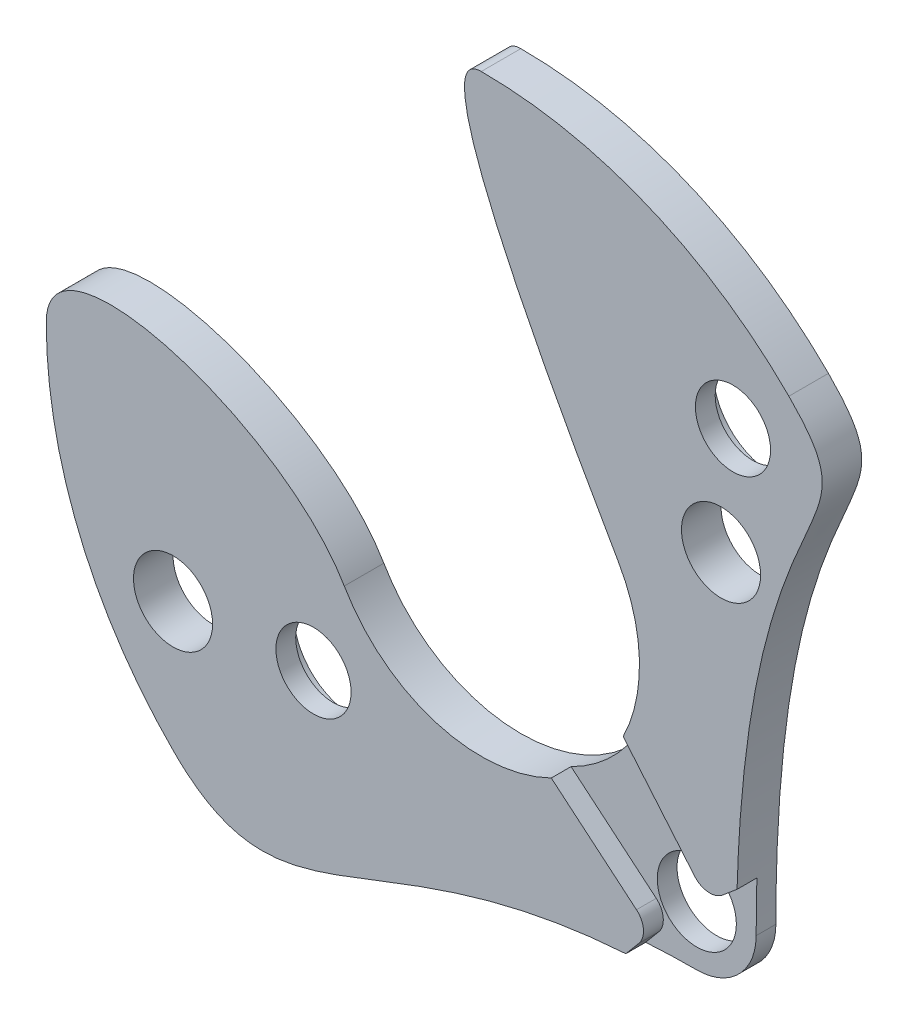
ISO-10303-21;
HEADER;
FILE_DESCRIPTION(('STEP AP214'),'2;1');
FILE_NAME('part.step','',(''),(''),'','','');
FILE_SCHEMA(('AUTOMOTIVE_DESIGN { 1 0 10303 214 1 1 1 1 }'));
ENDSEC;
DATA;
#1=APPLICATION_CONTEXT('core data for automotive mechanical design processes');
#2=APPLICATION_PROTOCOL_DEFINITION('international standard','automotive_design',2000,#1);
#3=PRODUCT_CONTEXT('',#1,'mechanical');
#4=PRODUCT('Part','Part','',(#3));
#5=PRODUCT_RELATED_PRODUCT_CATEGORY('part','',(#4));
#6=PRODUCT_DEFINITION_FORMATION('','',#4);
#7=PRODUCT_DEFINITION_CONTEXT('part definition',#1,'design');
#8=PRODUCT_DEFINITION('design','',#6,#7);
#9=PRODUCT_DEFINITION_SHAPE('','',#8);
#10=(LENGTH_UNIT() NAMED_UNIT(*) SI_UNIT(.MILLI.,.METRE.));
#11=(NAMED_UNIT(*) PLANE_ANGLE_UNIT() SI_UNIT($,.RADIAN.));
#12=(NAMED_UNIT(*) SI_UNIT($,.STERADIAN.) SOLID_ANGLE_UNIT());
#13=UNCERTAINTY_MEASURE_WITH_UNIT(LENGTH_MEASURE(1.E-05),#10,'distance_accuracy_value','');
#14=(GEOMETRIC_REPRESENTATION_CONTEXT(3) GLOBAL_UNCERTAINTY_ASSIGNED_CONTEXT((#13)) GLOBAL_UNIT_ASSIGNED_CONTEXT((#10,
#11,#12)) REPRESENTATION_CONTEXT('',''));
#15=CARTESIAN_POINT('',(0.,0.,0.));
#16=DIRECTION('',(0.,0.,1.));
#17=DIRECTION('',(1.,0.,0.));
#18=AXIS2_PLACEMENT_3D('',#15,#16,#17);
#19=CARTESIAN_POINT('',(2.47487373415291,-2.47487373415292,0.5));
#20=DIRECTION('',(0.,0.,-1.));
#21=DIRECTION('',(-1.,0.,0.));
#22=AXIS2_PLACEMENT_3D('',#19,#20,#21);
#23=CYLINDRICAL_SURFACE('',#22,0.75);
#24=CARTESIAN_POINT('',(2.47487373415291,-2.47487373415292,0.25));
#25=DIRECTION('',(0.,0.,1.));
#26=DIRECTION('',(1.,0.,0.));
#27=AXIS2_PLACEMENT_3D('',#24,#25,#26);
#28=CIRCLE('',#27,0.75);
#29=CARTESIAN_POINT('',(2.47487376398667,-3.22487373415292,0.25));
#30=VERTEX_POINT('',#29);
#31=CARTESIAN_POINT('',(3.22487373415291,-2.4748737603287,0.25));
#32=VERTEX_POINT('',#31);
#33=EDGE_CURVE('E237',#30,#32,#28,.T.);
#34=ORIENTED_EDGE('',*,*,#33,.F.);
#35=DIRECTION('',(0.,0.,-1.));
#36=VECTOR('',#35,1.);
#37=CARTESIAN_POINT('',(2.47487373415291,-3.22487373415292,0.5));
#38=LINE('',#37,#36);
#39=CARTESIAN_POINT('',(2.47487373415291,-3.22487373415292,0.));
#40=VERTEX_POINT('',#39);
#41=EDGE_CURVE('E215',#30,#40,#38,.T.);
#42=ORIENTED_EDGE('',*,*,#41,.T.);
#43=CARTESIAN_POINT('',(2.47487373415291,-2.47487373415292,0.));
#44=DIRECTION('',(0.,0.,1.));
#45=DIRECTION('',(1.,0.,0.));
#46=AXIS2_PLACEMENT_3D('',#43,#44,#45);
#47=CIRCLE('',#46,0.75);
#48=CARTESIAN_POINT('',(3.22487373415291,-2.47487373415292,0.));
#49=VERTEX_POINT('',#48);
#50=EDGE_CURVE('E457',#40,#49,#47,.T.);
#51=ORIENTED_EDGE('',*,*,#50,.T.);
#52=DIRECTION('',(0.,0.,-1.));
#53=VECTOR('',#52,1.);
#54=CARTESIAN_POINT('',(3.22487373415291,-2.47487373415292,0.5));
#55=LINE('',#54,#53);
#56=EDGE_CURVE('E127',#32,#49,#55,.T.);
#57=ORIENTED_EDGE('',*,*,#56,.F.);
#58=EDGE_LOOP('',(#34,#42,#51,#57));
#59=FACE_BOUND('',#58,.T.);
#60=ADVANCED_FACE('F40',(#59),#23,.T.);
#61=CARTESIAN_POINT('',(2.47487373415291,-2.47487373415292,0.5));
#62=DIRECTION('',(0.,0.,-1.));
#63=DIRECTION('',(-1.,0.,0.));
#64=AXIS2_PLACEMENT_3D('',#61,#62,#63);
#65=CYLINDRICAL_SURFACE('',#64,0.5);
#66=CARTESIAN_POINT('',(2.47487373415291,-2.47487373415292,0.));
#67=DIRECTION('',(0.,0.,1.));
#68=DIRECTION('',(1.,0.,0.));
#69=AXIS2_PLACEMENT_3D('',#66,#67,#68);
#70=CIRCLE('',#69,0.5);
#71=CARTESIAN_POINT('',(2.97487373415291,-2.47487373415292,0.));
#72=VERTEX_POINT('',#71);
#73=EDGE_CURVE('E289',#72,#72,#70,.T.);
#74=ORIENTED_EDGE('',*,*,#73,.F.);
#75=EDGE_LOOP('',(#74));
#76=FACE_BOUND('',#75,.T.);
#77=CARTESIAN_POINT('',(2.47487373415291,-2.47487373415292,0.25));
#78=DIRECTION('',(0.,0.,1.));
#79=DIRECTION('',(1.,0.,0.));
#80=AXIS2_PLACEMENT_3D('',#77,#78,#79);
#81=CIRCLE('',#80,0.5);
#82=CARTESIAN_POINT('',(2.97487373415291,-2.47487373415292,0.25));
#83=VERTEX_POINT('',#82);
#84=EDGE_CURVE('E152',#83,#83,#81,.T.);
#85=ORIENTED_EDGE('',*,*,#84,.T.);
#86=EDGE_LOOP('',(#85));
#87=FACE_BOUND('',#86,.T.);
#88=ADVANCED_FACE('F42',(#76,#87),#65,.F.);
#89=CARTESIAN_POINT('',(-0.494504817633697,-10.7938034400006,0.5));
#90=DIRECTION('',(0.,0.,1.));
#91=DIRECTION('',(1.,0.,0.));
#92=AXIS2_PLACEMENT_3D('',#89,#90,#91);
#93=PLANE('',#92);
#94=CARTESIAN_POINT('',(3.18198051533946,3.18198051533947,0.5));
#95=DIRECTION('',(0.,0.,1.));
#96=DIRECTION('',(1.,0.,0.));
#97=AXIS2_PLACEMENT_3D('',#94,#95,#96);
#98=CIRCLE('',#97,0.474999999999994);
#99=CARTESIAN_POINT('',(3.65698051533945,3.18198051533947,0.5));
#100=VERTEX_POINT('',#99);
#101=EDGE_CURVE('E306',#100,#100,#98,.T.);
#102=ORIENTED_EDGE('',*,*,#101,.F.);
#103=EDGE_LOOP('',(#102));
#104=FACE_BOUND('',#103,.T.);
#105=DIRECTION('',(-0.642787609686543,0.766044443118975,0.));
#106=VECTOR('',#105,1.);
#107=CARTESIAN_POINT('',(2.69719905329076,-1.96196881852991,0.5));
#108=LINE('',#107,#106);
#109=CARTESIAN_POINT('',(2.69719905329076,-1.96196881852991,0.5));
#110=VERTEX_POINT('',#109);
#111=CARTESIAN_POINT('',(1.79352882702642,-0.885016579858958,0.5));
#112=VERTEX_POINT('',#111);
#113=EDGE_CURVE('E319',#110,#112,#108,.T.);
#114=ORIENTED_EDGE('',*,*,#113,.F.);
#115=CARTESIAN_POINT('',(2.88871016407051,-1.80127191610827,0.5));
#116=DIRECTION('',(0.,0.,-1.));
#117=DIRECTION('',(-1.,0.,0.));
#118=AXIS2_PLACEMENT_3D('',#115,#116,#117);
#119=CIRCLE('',#118,0.25);
#120=CARTESIAN_POINT('',(3.04940706649214,-1.99278302688801,0.5));
#121=VERTEX_POINT('',#120);
#122=EDGE_CURVE('E316',#121,#110,#119,.T.);
#123=ORIENTED_EDGE('',*,*,#122,.F.);
#124=DIRECTION('',(-0.766044443119986,-0.642787609685338,0.));
#125=VECTOR('',#124,1.);
#126=CARTESIAN_POINT('',(3.04940706649214,-1.99278302688801,0.5));
#127=LINE('',#126,#125);
#128=CARTESIAN_POINT('',(3.23387528673452,-1.8379958113192,0.5));
#129=VERTEX_POINT('',#128);
#130=EDGE_CURVE('E144',#129,#121,#127,.T.);
#131=ORIENTED_EDGE('',*,*,#130,.F.);
#132=CARTESIAN_POINT('',(3.889087296526,3.88908729652602,0.5));
#133=CARTESIAN_POINT('',(5.1328934329392,2.64528116011282,0.5));
#134=CARTESIAN_POINT('',(3.22487373415291,3.01462721204346,0.5));
#135=CARTESIAN_POINT('',(3.22487373415291,-2.47487373415291,0.5));
#136=B_SPLINE_CURVE_WITH_KNOTS('',3,(#132,#133,#134,#135),.UNSPECIFIED.,.F.,.F.,(4,4),(0.,
0.76389692420124),.UNSPECIFIED.);
#137=CARTESIAN_POINT('',(3.88908729652601,3.88908729652602,0.5));
#138=VERTEX_POINT('',#137);
#139=EDGE_CURVE('E121',#138,#129,#136,.T.);
#140=ORIENTED_EDGE('',*,*,#139,.F.);
#141=CARTESIAN_POINT('',(0.,0.,0.5));
#142=DIRECTION('',(0.,0.,1.));
#143=DIRECTION('',(1.,0.,0.));
#144=AXIS2_PLACEMENT_3D('',#141,#142,#143);
#145=CIRCLE('',#144,5.5);
#146=CARTESIAN_POINT('',(0.,5.5,0.5));
#147=VERTEX_POINT('',#146);
#148=EDGE_CURVE('E131',#138,#147,#145,.T.);
#149=ORIENTED_EDGE('',*,*,#148,.T.);
#150=CARTESIAN_POINT('',(1.73205080756888,1.,0.5));
#151=CARTESIAN_POINT('',(0.948721343771961,2.35676643036194,0.5));
#152=CARTESIAN_POINT('',(-0.820788378407405,5.5,0.5));
#153=CARTESIAN_POINT('',(0.,5.5,0.5));
#154=B_SPLINE_CURVE_WITH_KNOTS('',3,(#150,#151,#152,#153),.UNSPECIFIED.,.F.,.F.,(4,4),(0.,1.),.UNSPECIFIED.);
#155=CARTESIAN_POINT('',(1.73205080756888,1.,0.5));
#156=VERTEX_POINT('',#155);
#157=EDGE_CURVE('E136',#156,#147,#154,.T.);
#158=ORIENTED_EDGE('',*,*,#157,.F.);
#159=CARTESIAN_POINT('',(0.,0.,0.5));
#160=DIRECTION('',(0.,0.,1.));
#161=DIRECTION('',(1.,0.,0.));
#162=AXIS2_PLACEMENT_3D('',#159,#160,#161);
#163=CIRCLE('',#162,2.);
#164=EDGE_CURVE('E66',#112,#156,#163,.T.);
#165=ORIENTED_EDGE('',*,*,#164,.F.);
#166=EDGE_LOOP('',(#114,#123,#131,#140,#149,#158,#165));
#167=FACE_BOUND('',#166,.T.);
#168=CARTESIAN_POINT('',(3.03108891324553,1.75,0.5));
#169=DIRECTION('',(0.,0.,1.));
#170=DIRECTION('',(1.,0.,0.));
#171=AXIS2_PLACEMENT_3D('',#168,#169,#170);
#172=CIRCLE('',#171,0.5);
#173=CARTESIAN_POINT('',(3.53108891324553,1.75,0.5));
#174=VERTEX_POINT('',#173);
#175=EDGE_CURVE('E292',#174,#174,#172,.T.);
#176=ORIENTED_EDGE('',*,*,#175,.F.);
#177=EDGE_LOOP('',(#176));
#178=FACE_BOUND('',#177,.T.);
#179=ADVANCED_FACE('F140',(#104,#167,#178),#93,.T.);
#180=CARTESIAN_POINT('',(0.,0.,0.5));
#181=DIRECTION('',(0.,0.,-1.));
#182=DIRECTION('',(-1.,0.,0.));
#183=AXIS2_PLACEMENT_3D('',#180,#181,#182);
#184=CYLINDRICAL_SURFACE('',#183,2.);
#185=DIRECTION('',(0.,0.,1.));
#186=VECTOR('',#185,1.);
#187=CARTESIAN_POINT('',(1.79352882702642,-0.885016579858958,0.25));
#188=LINE('',#187,#186);
#189=CARTESIAN_POINT('',(1.79352882702642,-0.885016579858958,0.25));
#190=VERTEX_POINT('',#189);
#191=EDGE_CURVE('E323',#190,#112,#188,.T.);
#192=ORIENTED_EDGE('',*,*,#191,.T.);
#193=ORIENTED_EDGE('',*,*,#164,.T.);
#194=DIRECTION('',(0.,0.,-1.));
#195=VECTOR('',#194,1.);
#196=CARTESIAN_POINT('',(1.73205080756888,1.,0.5));
#197=LINE('',#196,#195);
#198=CARTESIAN_POINT('',(1.73205080756888,1.,0.));
#199=VERTEX_POINT('',#198);
#200=EDGE_CURVE('E96',#156,#199,#197,.T.);
#201=ORIENTED_EDGE('',*,*,#200,.T.);
#202=CARTESIAN_POINT('',(0.,0.,0.));
#203=DIRECTION('',(0.,0.,1.));
#204=DIRECTION('',(1.,0.,0.));
#205=AXIS2_PLACEMENT_3D('',#202,#203,#204);
#206=CIRCLE('',#205,2.);
#207=CARTESIAN_POINT('',(-1.73205080756888,-1.,0.));
#208=VERTEX_POINT('',#207);
#209=EDGE_CURVE('E420',#208,#199,#206,.T.);
#210=ORIENTED_EDGE('',*,*,#209,.F.);
#211=DIRECTION('',(0.,0.,-1.));
#212=VECTOR('',#211,1.);
#213=CARTESIAN_POINT('',(-1.73205080756888,-1.,0.5));
#214=LINE('',#213,#212);
#215=CARTESIAN_POINT('',(-1.73205080756888,-1.,0.5));
#216=VERTEX_POINT('',#215);
#217=EDGE_CURVE('E11',#216,#208,#214,.T.);
#218=ORIENTED_EDGE('',*,*,#217,.F.);
#219=CARTESIAN_POINT('',(0.885016579858952,-1.79352882702642,0.5));
#220=VERTEX_POINT('',#219);
#221=EDGE_CURVE('E195',#216,#220,#163,.T.);
#222=ORIENTED_EDGE('',*,*,#221,.T.);
#223=DIRECTION('',(0.,0.,1.));
#224=VECTOR('',#223,1.);
#225=CARTESIAN_POINT('',(0.885016579858951,-1.79352882702642,0.25));
#226=LINE('',#225,#224);
#227=CARTESIAN_POINT('',(0.885016579858951,-1.79352882702642,0.25));
#228=VERTEX_POINT('',#227);
#229=EDGE_CURVE('E57',#228,#220,#226,.T.);
#230=ORIENTED_EDGE('',*,*,#229,.F.);
#231=CARTESIAN_POINT('',(0.,0.,0.25));
#232=DIRECTION('',(0.,0.,-1.));
#233=DIRECTION('',(1.,0.,0.));
#234=AXIS2_PLACEMENT_3D('',#231,#232,#233);
#235=CIRCLE('',#234,2.);
#236=EDGE_CURVE('E322',#190,#228,#235,.T.);
#237=ORIENTED_EDGE('',*,*,#236,.F.);
#238=EDGE_LOOP('',(#192,#193,#201,#210,#218,#222,#230,#237));
#239=FACE_BOUND('',#238,.T.);
#240=ADVANCED_FACE('F186',(#239),#184,.F.);
#241=CARTESIAN_POINT('',(-1.73205080756888,-1.,0.5));
#242=CARTESIAN_POINT('',(-2.51538027136579,0.356766430361937,0.5));
#243=CARTESIAN_POINT('',(-5.5,1.2621162955933,0.5));
#244=CARTESIAN_POINT('',(-5.5,0.,0.5));
#245=B_SPLINE_CURVE_WITH_KNOTS('',3,(#241,#242,#243,#244),.UNSPECIFIED.,.F.,.F.,(4,4),(0.,1.),.UNSPECIFIED.);
#246=DIRECTION('',(0.,0.,-1.));
#247=VECTOR('',#246,1.);
#248=SURFACE_OF_LINEAR_EXTRUSION('',#245,#247);
#249=CARTESIAN_POINT('',(-1.73205080756888,-1.,0.));
#250=CARTESIAN_POINT('',(-2.51538027136579,0.356766430361937,0.));
#251=CARTESIAN_POINT('',(-5.5,1.2621162955933,0.));
#252=CARTESIAN_POINT('',(-5.5,0.,0.));
#253=B_SPLINE_CURVE_WITH_KNOTS('',3,(#249,#250,#251,#252),.UNSPECIFIED.,.F.,.F.,(4,4),(0.,1.),.UNSPECIFIED.);
#254=CARTESIAN_POINT('',(-5.5,0.,0.));
#255=VERTEX_POINT('',#254);
#256=EDGE_CURVE('E423',#208,#255,#253,.T.);
#257=ORIENTED_EDGE('',*,*,#256,.T.);
#258=DIRECTION('',(0.,0.,-1.));
#259=VECTOR('',#258,1.);
#260=CARTESIAN_POINT('',(-5.5,0.,0.5));
#261=LINE('',#260,#259);
#262=CARTESIAN_POINT('',(-5.5,0.,0.5));
#263=VERTEX_POINT('',#262);
#264=EDGE_CURVE('E49',#263,#255,#261,.T.);
#265=ORIENTED_EDGE('',*,*,#264,.F.);
#266=EDGE_CURVE('E189',#216,#263,#245,.T.);
#267=ORIENTED_EDGE('',*,*,#266,.F.);
#268=ORIENTED_EDGE('',*,*,#217,.T.);
#269=EDGE_LOOP('',(#257,#265,#267,#268));
#270=FACE_BOUND('',#269,.T.);
#271=ADVANCED_FACE('F181',(#270),#248,.F.);
#272=CARTESIAN_POINT('',(0.,0.,0.5));
#273=DIRECTION('',(0.,0.,-1.));
#274=DIRECTION('',(-1.,0.,0.));
#275=AXIS2_PLACEMENT_3D('',#272,#273,#274);
#276=CYLINDRICAL_SURFACE('',#275,5.5);
#277=CARTESIAN_POINT('',(0.,0.,0.));
#278=DIRECTION('',(0.,0.,1.));
#279=DIRECTION('',(1.,0.,0.));
#280=AXIS2_PLACEMENT_3D('',#277,#278,#279);
#281=CIRCLE('',#280,5.5);
#282=CARTESIAN_POINT('',(-3.889087296526,-3.88908729652602,0.));
#283=VERTEX_POINT('',#282);
#284=EDGE_CURVE('E212',#255,#283,#281,.T.);
#285=ORIENTED_EDGE('',*,*,#284,.T.);
#286=DIRECTION('',(0.,0.,-1.));
#287=VECTOR('',#286,1.);
#288=CARTESIAN_POINT('',(-3.889087296526,-3.88908729652602,0.5));
#289=LINE('',#288,#287);
#290=CARTESIAN_POINT('',(-3.889087296526,-3.88908729652602,0.5));
#291=VERTEX_POINT('',#290);
#292=EDGE_CURVE('E211',#291,#283,#289,.T.);
#293=ORIENTED_EDGE('',*,*,#292,.F.);
#294=CARTESIAN_POINT('',(0.,0.,0.5));
#295=DIRECTION('',(0.,0.,1.));
#296=DIRECTION('',(1.,0.,0.));
#297=AXIS2_PLACEMENT_3D('',#294,#295,#296);
#298=CIRCLE('',#297,5.5);
#299=EDGE_CURVE('E147',#263,#291,#298,.T.);
#300=ORIENTED_EDGE('',*,*,#299,.F.);
#301=ORIENTED_EDGE('',*,*,#264,.T.);
#302=EDGE_LOOP('',(#285,#293,#300,#301));
#303=FACE_BOUND('',#302,.T.);
#304=ADVANCED_FACE('F177',(#303),#276,.T.);
#305=CARTESIAN_POINT('',(2.47487373415291,-3.22487373415292,0.5));
#306=CARTESIAN_POINT('',(-1.35865781035541,-3.22487373415292,0.5));
#307=CARTESIAN_POINT('',(-2.38895101914465,-5.38922357390737,0.5));
#308=CARTESIAN_POINT('',(-3.889087296526,-3.88908729652602,0.5));
#309=B_SPLINE_CURVE_WITH_KNOTS('',3,(#305,#306,#307,#308),.UNSPECIFIED.,.F.,.F.,(4,4),(0.,1.),.UNSPECIFIED.);
#310=DIRECTION('',(0.,0.,-1.));
#311=VECTOR('',#310,1.);
#312=SURFACE_OF_LINEAR_EXTRUSION('',#309,#311);
#313=DIRECTION('',(0.,0.,-1.));
#314=VECTOR('',#313,1.);
#315=CARTESIAN_POINT('',(1.82774500199745,-3.24609172557136,0.375));
#316=LINE('',#315,#314);
#317=CARTESIAN_POINT('',(1.82774500199745,-3.24609172557135,0.25));
#318=VERTEX_POINT('',#317);
#319=CARTESIAN_POINT('',(1.82774500199745,-3.24609172557135,0.5));
#320=VERTEX_POINT('',#319);
#321=EDGE_CURVE('E224',#318,#320,#316,.F.);
#322=ORIENTED_EDGE('',*,*,#321,.T.);
#323=EDGE_CURVE('E145',#320,#291,#309,.T.);
#324=ORIENTED_EDGE('',*,*,#323,.T.);
#325=ORIENTED_EDGE('',*,*,#292,.T.);
#326=CARTESIAN_POINT('',(2.47487373415291,-3.22487373415292,0.));
#327=CARTESIAN_POINT('',(-1.35865781035541,-3.22487373415292,0.));
#328=CARTESIAN_POINT('',(-2.38895101914465,-5.38922357390737,0.));
#329=CARTESIAN_POINT('',(-3.889087296526,-3.88908729652602,0.));
#330=B_SPLINE_CURVE_WITH_KNOTS('',3,(#326,#327,#328,#329),.UNSPECIFIED.,.F.,.F.,(4,4),(0.,1.),.UNSPECIFIED.);
#331=EDGE_CURVE('E453',#40,#283,#330,.T.);
#332=ORIENTED_EDGE('',*,*,#331,.F.);
#333=ORIENTED_EDGE('',*,*,#41,.F.);
#334=CARTESIAN_POINT('',(1.82774500199745,-3.24609172557135,0.25));
#335=CARTESIAN_POINT('',(1.86365053052916,-3.243700367341,0.25));
#336=CARTESIAN_POINT('',(1.89956980319246,-3.24151639201898,0.25));
#337=CARTESIAN_POINT('',(1.97142198594582,-3.2375585421549,0.25));
#338=CARTESIAN_POINT('',(2.0073548904231,-3.23578456576244,0.25));
#339=CARTESIAN_POINT('',(2.07923401625193,-3.23264105398086,0.25));
#340=CARTESIAN_POINT('',(2.11518023547591,-3.23127146986118,0.25));
#341=CARTESIAN_POINT('',(2.18708546526036,-3.22893097957115,0.25));
#342=CARTESIAN_POINT('',(2.22304447576007,-3.22796007153133,0.25));
#343=CARTESIAN_POINT('',(2.29497543359178,-3.22641116453418,0.25));
#344=CARTESIAN_POINT('',(2.33094738198003,-3.22583321480663,0.25));
#345=CARTESIAN_POINT('',(2.40290416423566,-3.22506443963408,0.25));
#346=CARTESIAN_POINT('',(2.4388889991106,-3.22487370825222,0.25));
#347=CARTESIAN_POINT('',(2.47487376398667,-3.22487373415292,0.25));
#348=B_SPLINE_CURVE_WITH_KNOTS('',3,(#334,#335,#336,#337,#338,#339,#340,#341,#342,#343,#344,
#345,#346,#347),.UNSPECIFIED.,.F.,.F.,(4,2,2,2,2,2,4),(0.,0.107954523724107,0.215882200891527,
0.323796867114626,0.431711027298476,0.539638704467747,0.64759259631236),.UNSPECIFIED.);
#349=EDGE_CURVE('E241',#318,#30,#348,.T.);
#350=ORIENTED_EDGE('',*,*,#349,.F.);
#351=EDGE_LOOP('',(#322,#324,#325,#332,#333,#350));
#352=FACE_BOUND('',#351,.T.);
#353=ADVANCED_FACE('F170',(#352),#312,.T.);
#354=DIRECTION('',(0.,0.,-1.));
#355=VECTOR('',#354,1.);
#356=SURFACE_OF_LINEAR_EXTRUSION('',#136,#355);
#357=DIRECTION('',(0.,0.,-1.));
#358=VECTOR('',#357,1.);
#359=CARTESIAN_POINT('',(3.23387528673452,-1.8379958113192,0.375));
#360=LINE('',#359,#358);
#361=CARTESIAN_POINT('',(3.23387528673452,-1.8379958113192,0.25));
#362=VERTEX_POINT('',#361);
#363=EDGE_CURVE('E227',#362,#129,#360,.F.);
#364=ORIENTED_EDGE('',*,*,#363,.F.);
#365=CARTESIAN_POINT('',(3.22487373415291,-2.4748737603287,0.25));
#366=CARTESIAN_POINT('',(3.22487386077048,-2.42179213661784,0.25));
#367=CARTESIAN_POINT('',(3.22505213954659,-2.36871041483332,0.25));
#368=CARTESIAN_POINT('',(3.22577886468152,-2.26255230680199,0.25));
#369=CARTESIAN_POINT('',(3.22632729161678,-2.20947592042136,0.25));
#370=CARTESIAN_POINT('',(3.22780817417168,-2.10332839110768,0.25));
#371=CARTESIAN_POINT('',(3.22874063017267,-2.05025724817988,0.25));
#372=CARTESIAN_POINT('',(3.23100475274686,-1.94412071150375,0.25));
#373=CARTESIAN_POINT('',(3.23233644026555,-1.89105531820324,0.25));
#374=CARTESIAN_POINT('',(3.23387528673452,-1.8379958113192,0.25));
#375=B_SPLINE_CURVE_WITH_KNOTS('',3,(#365,#366,#367,#368,#369,#370,#371,#372,#373,#374),
.UNSPECIFIED.,.F.,.F.,(4,2,2,2,4),(0.,0.15924471371625,0.318481071696738,0.477717587800523,
0.636962459631773),.UNSPECIFIED.);
#376=EDGE_CURVE('E240',#32,#362,#375,.T.);
#377=ORIENTED_EDGE('',*,*,#376,.F.);
#378=ORIENTED_EDGE('',*,*,#56,.T.);
#379=CARTESIAN_POINT('',(3.889087296526,3.88908729652602,0.));
#380=CARTESIAN_POINT('',(5.1328934329392,2.64528116011282,0.));
#381=CARTESIAN_POINT('',(3.22487373415291,3.01462721204346,0.));
#382=CARTESIAN_POINT('',(3.22487373415291,-2.47487373415291,0.));
#383=B_SPLINE_CURVE_WITH_KNOTS('',3,(#379,#380,#381,#382),.UNSPECIFIED.,.F.,.F.,(4,4),(0.,
0.76389692420124),.UNSPECIFIED.);
#384=CARTESIAN_POINT('',(3.88908729652601,3.88908729652602,0.));
#385=VERTEX_POINT('',#384);
#386=EDGE_CURVE('E123',#385,#49,#383,.T.);
#387=ORIENTED_EDGE('',*,*,#386,.F.);
#388=DIRECTION('',(0.,0.,-1.));
#389=VECTOR('',#388,1.);
#390=CARTESIAN_POINT('',(3.88908729652601,3.88908729652602,0.5));
#391=LINE('',#390,#389);
#392=EDGE_CURVE('E115',#138,#385,#391,.T.);
#393=ORIENTED_EDGE('',*,*,#392,.F.);
#394=ORIENTED_EDGE('',*,*,#139,.T.);
#395=EDGE_LOOP('',(#364,#377,#378,#387,#393,#394));
#396=FACE_BOUND('',#395,.T.);
#397=ADVANCED_FACE('F118',(#396),#356,.T.);
#398=CARTESIAN_POINT('',(0.,0.,0.5));
#399=DIRECTION('',(0.,0.,-1.));
#400=DIRECTION('',(-1.,0.,0.));
#401=AXIS2_PLACEMENT_3D('',#398,#399,#400);
#402=CYLINDRICAL_SURFACE('',#401,5.5);
#403=CARTESIAN_POINT('',(0.,0.,0.));
#404=DIRECTION('',(0.,0.,1.));
#405=DIRECTION('',(1.,0.,0.));
#406=AXIS2_PLACEMENT_3D('',#403,#404,#405);
#407=CIRCLE('',#406,5.5);
#408=CARTESIAN_POINT('',(0.,5.5,0.));
#409=VERTEX_POINT('',#408);
#410=EDGE_CURVE('E425',#385,#409,#407,.T.);
#411=ORIENTED_EDGE('',*,*,#410,.T.);
#412=DIRECTION('',(0.,0.,-1.));
#413=VECTOR('',#412,1.);
#414=CARTESIAN_POINT('',(0.,5.5,0.5));
#415=LINE('',#414,#413);
#416=EDGE_CURVE('E128',#147,#409,#415,.T.);
#417=ORIENTED_EDGE('',*,*,#416,.F.);
#418=ORIENTED_EDGE('',*,*,#148,.F.);
#419=ORIENTED_EDGE('',*,*,#392,.T.);
#420=EDGE_LOOP('',(#411,#417,#418,#419));
#421=FACE_BOUND('',#420,.T.);
#422=ADVANCED_FACE('F132',(#421),#402,.T.);
#423=CARTESIAN_POINT('',(-3.89711431702997,-2.25,0.5));
#424=DIRECTION('',(0.,0.,-1.));
#425=DIRECTION('',(-1.,0.,0.));
#426=AXIS2_PLACEMENT_3D('',#423,#424,#425);
#427=CYLINDRICAL_SURFACE('',#426,0.499999999999999);
#428=CARTESIAN_POINT('',(-3.89711431702997,-2.25,0.5));
#429=DIRECTION('',(0.,0.,1.));
#430=DIRECTION('',(1.,0.,0.));
#431=AXIS2_PLACEMENT_3D('',#428,#429,#430);
#432=CIRCLE('',#431,0.499999999999999);
#433=CARTESIAN_POINT('',(-3.39711431702997,-2.25,0.5));
#434=VERTEX_POINT('',#433);
#435=EDGE_CURVE('E294',#434,#434,#432,.T.);
#436=ORIENTED_EDGE('',*,*,#435,.T.);
#437=EDGE_LOOP('',(#436));
#438=FACE_BOUND('',#437,.T.);
#439=CARTESIAN_POINT('',(-3.89711431702997,-2.25,0.));
#440=DIRECTION('',(0.,0.,1.));
#441=DIRECTION('',(1.,0.,0.));
#442=AXIS2_PLACEMENT_3D('',#439,#440,#441);
#443=CIRCLE('',#442,0.499999999999999);
#444=CARTESIAN_POINT('',(-3.39711431702997,-2.25,0.));
#445=VERTEX_POINT('',#444);
#446=EDGE_CURVE('E417',#445,#445,#443,.T.);
#447=ORIENTED_EDGE('',*,*,#446,.F.);
#448=EDGE_LOOP('',(#447));
#449=FACE_BOUND('',#448,.T.);
#450=ADVANCED_FACE('F675',(#438,#449),#427,.F.);
#451=CARTESIAN_POINT('',(3.03108891324553,1.75,0.5));
#452=DIRECTION('',(0.,0.,-1.));
#453=DIRECTION('',(-1.,0.,0.));
#454=AXIS2_PLACEMENT_3D('',#451,#452,#453);
#455=CYLINDRICAL_SURFACE('',#454,0.5);
#456=ORIENTED_EDGE('',*,*,#175,.T.);
#457=EDGE_LOOP('',(#456));
#458=FACE_BOUND('',#457,.T.);
#459=CARTESIAN_POINT('',(3.03108891324553,1.75,0.));
#460=DIRECTION('',(0.,0.,1.));
#461=DIRECTION('',(1.,0.,0.));
#462=AXIS2_PLACEMENT_3D('',#459,#460,#461);
#463=CIRCLE('',#462,0.5);
#464=CARTESIAN_POINT('',(3.53108891324553,1.75,0.));
#465=VERTEX_POINT('',#464);
#466=EDGE_CURVE('E413',#465,#465,#463,.T.);
#467=ORIENTED_EDGE('',*,*,#466,.F.);
#468=EDGE_LOOP('',(#467));
#469=FACE_BOUND('',#468,.T.);
#470=ADVANCED_FACE('F378',(#458,#469),#455,.F.);
#471=DIRECTION('',(0.,0.,-1.));
#472=VECTOR('',#471,1.);
#473=SURFACE_OF_LINEAR_EXTRUSION('',#154,#472);
#474=CARTESIAN_POINT('',(1.73205080756888,1.,0.));
#475=CARTESIAN_POINT('',(0.948721343771961,2.35676643036194,0.));
#476=CARTESIAN_POINT('',(-0.820788378407405,5.5,0.));
#477=CARTESIAN_POINT('',(0.,5.5,0.));
#478=B_SPLINE_CURVE_WITH_KNOTS('',3,(#474,#475,#476,#477),.UNSPECIFIED.,.F.,.F.,(4,4),(0.,1.),.UNSPECIFIED.);
#479=EDGE_CURVE('E295',#199,#409,#478,.T.);
#480=ORIENTED_EDGE('',*,*,#479,.F.);
#481=ORIENTED_EDGE('',*,*,#200,.F.);
#482=ORIENTED_EDGE('',*,*,#157,.T.);
#483=ORIENTED_EDGE('',*,*,#416,.T.);
#484=EDGE_LOOP('',(#480,#481,#482,#483));
#485=FACE_BOUND('',#484,.T.);
#486=ADVANCED_FACE('F369',(#485),#473,.T.);
#487=CARTESIAN_POINT('',(-2.12132034355964,-2.12132034355965,0.5));
#488=DIRECTION('',(0.,0.,1.));
#489=DIRECTION('',(1.,0.,0.));
#490=AXIS2_PLACEMENT_3D('',#487,#488,#489);
#491=CIRCLE('',#490,0.474999999999994);
#492=CARTESIAN_POINT('',(-1.64632034355964,-2.12132034355965,0.5));
#493=VERTEX_POINT('',#492);
#494=EDGE_CURVE('E44',#493,#493,#491,.T.);
#495=ORIENTED_EDGE('',*,*,#494,.F.);
#496=EDGE_LOOP('',(#495));
#497=FACE_BOUND('',#496,.T.);
#498=DIRECTION('',(-0.642787609684164,-0.766044443120971,0.));
#499=VECTOR('',#498,1.);
#500=CARTESIAN_POINT('',(1.992783026888,-3.04940706649215,0.5));
#501=LINE('',#500,#499);
#502=CARTESIAN_POINT('',(1.992783026888,-3.04940706649215,0.5));
#503=VERTEX_POINT('',#502);
#504=EDGE_CURVE('E231',#503,#320,#501,.T.);
#505=ORIENTED_EDGE('',*,*,#504,.F.);
#506=CARTESIAN_POINT('',(1.80127191610826,-2.88871016407051,0.5));
#507=DIRECTION('',(0.,0.,-1.));
#508=DIRECTION('',(1.,0.,0.));
#509=AXIS2_PLACEMENT_3D('',#506,#507,#508);
#510=CIRCLE('',#509,0.25);
#511=CARTESIAN_POINT('',(1.9619688185299,-2.69719905329077,0.5));
#512=VERTEX_POINT('',#511);
#513=EDGE_CURVE('E234',#512,#503,#510,.T.);
#514=ORIENTED_EDGE('',*,*,#513,.F.);
#515=DIRECTION('',(0.766044443118973,-0.642787609686546,0.));
#516=VECTOR('',#515,1.);
#517=CARTESIAN_POINT('',(1.9619688185299,-2.69719905329077,0.5));
#518=LINE('',#517,#516);
#519=EDGE_CURVE('E302',#220,#512,#518,.T.);
#520=ORIENTED_EDGE('',*,*,#519,.F.);
#521=ORIENTED_EDGE('',*,*,#221,.F.);
#522=ORIENTED_EDGE('',*,*,#266,.T.);
#523=ORIENTED_EDGE('',*,*,#299,.T.);
#524=ORIENTED_EDGE('',*,*,#323,.F.);
#525=EDGE_LOOP('',(#505,#514,#520,#521,#522,#523,#524));
#526=FACE_BOUND('',#525,.T.);
#527=ORIENTED_EDGE('',*,*,#435,.F.);
#528=EDGE_LOOP('',(#527));
#529=FACE_BOUND('',#528,.T.);
#530=ADVANCED_FACE('F205',(#497,#526,#529),#93,.T.);
#531=CARTESIAN_POINT('',(-0.494504817633697,-10.7938034400006,0.));
#532=DIRECTION('',(0.,0.,1.));
#533=DIRECTION('',(1.,0.,0.));
#534=AXIS2_PLACEMENT_3D('',#531,#532,#533);
#535=PLANE('',#534);
#536=CARTESIAN_POINT('',(-2.12132034355964,-2.12132034355965,0.));
#537=DIRECTION('',(0.,0.,-1.));
#538=DIRECTION('',(-1.,0.,0.));
#539=AXIS2_PLACEMENT_3D('',#536,#537,#538);
#540=CIRCLE('',#539,0.75);
#541=CARTESIAN_POINT('',(-2.87132034355964,-2.12132034355965,0.));
#542=VERTEX_POINT('',#541);
#543=EDGE_CURVE('E283',#542,#542,#540,.T.);
#544=ORIENTED_EDGE('',*,*,#543,.F.);
#545=EDGE_LOOP('',(#544));
#546=FACE_BOUND('',#545,.T.);
#547=CARTESIAN_POINT('',(3.18198051533946,3.18198051533947,0.));
#548=DIRECTION('',(0.,0.,-1.));
#549=DIRECTION('',(-1.,0.,0.));
#550=AXIS2_PLACEMENT_3D('',#547,#548,#549);
#551=CIRCLE('',#550,0.75);
#552=CARTESIAN_POINT('',(2.43198051533946,3.18198051533947,0.));
#553=VERTEX_POINT('',#552);
#554=EDGE_CURVE('E282',#553,#553,#551,.T.);
#555=ORIENTED_EDGE('',*,*,#554,.F.);
#556=EDGE_LOOP('',(#555));
#557=FACE_BOUND('',#556,.T.);
#558=ORIENTED_EDGE('',*,*,#73,.T.);
#559=EDGE_LOOP('',(#558));
#560=FACE_BOUND('',#559,.T.);
#561=ORIENTED_EDGE('',*,*,#466,.T.);
#562=EDGE_LOOP('',(#561));
#563=FACE_BOUND('',#562,.T.);
#564=ORIENTED_EDGE('',*,*,#446,.T.);
#565=EDGE_LOOP('',(#564));
#566=FACE_BOUND('',#565,.T.);
#567=ORIENTED_EDGE('',*,*,#209,.T.);
#568=ORIENTED_EDGE('',*,*,#479,.T.);
#569=ORIENTED_EDGE('',*,*,#410,.F.);
#570=ORIENTED_EDGE('',*,*,#386,.T.);
#571=ORIENTED_EDGE('',*,*,#50,.F.);
#572=ORIENTED_EDGE('',*,*,#331,.T.);
#573=ORIENTED_EDGE('',*,*,#284,.F.);
#574=ORIENTED_EDGE('',*,*,#256,.F.);
#575=EDGE_LOOP('',(#567,#568,#569,#570,#571,#572,#573,#574));
#576=FACE_BOUND('',#575,.T.);
#577=ADVANCED_FACE('F368',(#546,#557,#560,#563,#566,#576),#535,.F.);
#578=CARTESIAN_POINT('',(3.18198051533946,3.18198051533947,0.25));
#579=DIRECTION('',(0.,0.,-1.));
#580=DIRECTION('',(-1.,0.,0.));
#581=AXIS2_PLACEMENT_3D('',#578,#579,#580);
#582=CYLINDRICAL_SURFACE('',#581,0.75);
#583=CARTESIAN_POINT('',(3.18198051533946,3.18198051533947,0.25));
#584=DIRECTION('',(0.,0.,-1.));
#585=DIRECTION('',(-1.,0.,0.));
#586=AXIS2_PLACEMENT_3D('',#583,#584,#585);
#587=CIRCLE('',#586,0.75);
#588=CARTESIAN_POINT('',(2.43198051533946,3.18198051533947,0.25));
#589=VERTEX_POINT('',#588);
#590=EDGE_CURVE('E286',#589,#589,#587,.T.);
#591=ORIENTED_EDGE('',*,*,#590,.F.);
#592=EDGE_LOOP('',(#591));
#593=FACE_BOUND('',#592,.T.);
#594=ORIENTED_EDGE('',*,*,#554,.T.);
#595=EDGE_LOOP('',(#594));
#596=FACE_BOUND('',#595,.T.);
#597=ADVANCED_FACE('F375',(#593,#596),#582,.F.);
#598=CARTESIAN_POINT('',(3.18198051533946,3.18198051533947,0.25));
#599=DIRECTION('',(0.,0.,-1.));
#600=DIRECTION('',(-1.,0.,0.));
#601=AXIS2_PLACEMENT_3D('',#598,#599,#600);
#602=PLANE('',#601);
#603=CARTESIAN_POINT('',(3.18198051533946,3.18198051533947,0.249999999999999));
#604=DIRECTION('',(0.,0.,-1.));
#605=DIRECTION('',(-1.,0.,0.));
#606=AXIS2_PLACEMENT_3D('',#603,#604,#605);
#607=CIRCLE('',#606,0.474999999999988);
#608=CARTESIAN_POINT('',(2.70698051533947,3.18198051533947,0.249999999999999));
#609=VERTEX_POINT('',#608);
#610=EDGE_CURVE('E310',#609,#609,#607,.T.);
#611=ORIENTED_EDGE('',*,*,#610,.F.);
#612=EDGE_LOOP('',(#611));
#613=FACE_BOUND('',#612,.T.);
#614=ORIENTED_EDGE('',*,*,#590,.T.);
#615=EDGE_LOOP('',(#614));
#616=FACE_BOUND('',#615,.T.);
#617=ADVANCED_FACE('F395',(#613,#616),#602,.T.);
#618=CARTESIAN_POINT('',(-2.12132034355964,-2.12132034355965,0.25));
#619=DIRECTION('',(0.,0.,-1.));
#620=DIRECTION('',(-1.,0.,0.));
#621=AXIS2_PLACEMENT_3D('',#618,#619,#620);
#622=CYLINDRICAL_SURFACE('',#621,0.75);
#623=CARTESIAN_POINT('',(-2.12132034355964,-2.12132034355965,0.25));
#624=DIRECTION('',(0.,0.,-1.));
#625=DIRECTION('',(-1.,0.,0.));
#626=AXIS2_PLACEMENT_3D('',#623,#624,#625);
#627=CIRCLE('',#626,0.75);
#628=CARTESIAN_POINT('',(-2.87132034355964,-2.12132034355965,0.25));
#629=VERTEX_POINT('',#628);
#630=EDGE_CURVE('E276',#629,#629,#627,.T.);
#631=ORIENTED_EDGE('',*,*,#630,.F.);
#632=EDGE_LOOP('',(#631));
#633=FACE_BOUND('',#632,.T.);
#634=ORIENTED_EDGE('',*,*,#543,.T.);
#635=EDGE_LOOP('',(#634));
#636=FACE_BOUND('',#635,.T.);
#637=ADVANCED_FACE('F398',(#633,#636),#622,.F.);
#638=CARTESIAN_POINT('',(-2.12132034355964,-2.12132034355965,0.25));
#639=DIRECTION('',(0.,0.,-1.));
#640=DIRECTION('',(-1.,0.,0.));
#641=AXIS2_PLACEMENT_3D('',#638,#639,#640);
#642=PLANE('',#641);
#643=CARTESIAN_POINT('',(-2.12132034355964,-2.12132034355965,0.249999999999999));
#644=DIRECTION('',(0.,0.,-1.));
#645=DIRECTION('',(-1.,0.,0.));
#646=AXIS2_PLACEMENT_3D('',#643,#644,#645);
#647=CIRCLE('',#646,0.474999999999988);
#648=CARTESIAN_POINT('',(-2.59632034355963,-2.12132034355965,0.249999999999999));
#649=VERTEX_POINT('',#648);
#650=EDGE_CURVE('E358',#649,#649,#647,.T.);
#651=ORIENTED_EDGE('',*,*,#650,.F.);
#652=EDGE_LOOP('',(#651));
#653=FACE_BOUND('',#652,.T.);
#654=ORIENTED_EDGE('',*,*,#630,.T.);
#655=EDGE_LOOP('',(#654));
#656=FACE_BOUND('',#655,.T.);
#657=ADVANCED_FACE('F266',(#653,#656),#642,.T.);
#658=CARTESIAN_POINT('',(2.69719905329076,-1.96196881852991,0.25));
#659=DIRECTION('',(0.766044443118975,0.642787609686543,0.));
#660=DIRECTION('',(-0.642787609686543,0.766044443118975,0.));
#661=AXIS2_PLACEMENT_3D('',#658,#659,#660);
#662=PLANE('',#661);
#663=ORIENTED_EDGE('',*,*,#113,.T.);
#664=ORIENTED_EDGE('',*,*,#191,.F.);
#665=DIRECTION('',(-0.642787609686543,0.766044443118975,0.));
#666=VECTOR('',#665,1.);
#667=CARTESIAN_POINT('',(2.69719905329076,-1.96196881852991,0.25));
#668=LINE('',#667,#666);
#669=CARTESIAN_POINT('',(2.69719905329076,-1.96196881852991,0.25));
#670=VERTEX_POINT('',#669);
#671=EDGE_CURVE('E313',#670,#190,#668,.T.);
#672=ORIENTED_EDGE('',*,*,#671,.F.);
#673=DIRECTION('',(0.,0.,1.));
#674=VECTOR('',#673,1.);
#675=CARTESIAN_POINT('',(2.69719905329076,-1.96196881852991,0.25));
#676=LINE('',#675,#674);
#677=EDGE_CURVE('E325',#670,#110,#676,.T.);
#678=ORIENTED_EDGE('',*,*,#677,.T.);
#679=EDGE_LOOP('',(#663,#664,#672,#678));
#680=FACE_BOUND('',#679,.T.);
#681=ADVANCED_FACE('F572',(#680),#662,.F.);
#682=CARTESIAN_POINT('',(2.88871016407051,-1.80127191610827,0.25));
#683=DIRECTION('',(0.,0.,1.));
#684=DIRECTION('',(1.,0.,0.));
#685=AXIS2_PLACEMENT_3D('',#682,#683,#684);
#686=CYLINDRICAL_SURFACE('',#685,0.25);
#687=ORIENTED_EDGE('',*,*,#122,.T.);
#688=ORIENTED_EDGE('',*,*,#677,.F.);
#689=CARTESIAN_POINT('',(2.88871016407051,-1.80127191610827,0.25));
#690=DIRECTION('',(0.,0.,-1.));
#691=DIRECTION('',(-1.,0.,0.));
#692=AXIS2_PLACEMENT_3D('',#689,#690,#691);
#693=CIRCLE('',#692,0.25);
#694=CARTESIAN_POINT('',(3.04940706649214,-1.99278302688801,0.25));
#695=VERTEX_POINT('',#694);
#696=EDGE_CURVE('E336',#695,#670,#693,.T.);
#697=ORIENTED_EDGE('',*,*,#696,.F.);
#698=DIRECTION('',(0.,0.,1.));
#699=VECTOR('',#698,1.);
#700=CARTESIAN_POINT('',(3.04940706649214,-1.99278302688801,0.25));
#701=LINE('',#700,#699);
#702=EDGE_CURVE('E328',#695,#121,#701,.T.);
#703=ORIENTED_EDGE('',*,*,#702,.T.);
#704=EDGE_LOOP('',(#687,#688,#697,#703));
#705=FACE_BOUND('',#704,.T.);
#706=ADVANCED_FACE('F501',(#705),#686,.T.);
#707=CARTESIAN_POINT('',(3.04940706649214,-1.99278302688801,0.25));
#708=DIRECTION('',(-0.642787609685338,0.766044443119986,0.));
#709=DIRECTION('',(-0.766044443119986,-0.642787609685338,0.));
#710=AXIS2_PLACEMENT_3D('',#707,#708,#709);
#711=PLANE('',#710);
#712=ORIENTED_EDGE('',*,*,#130,.T.);
#713=ORIENTED_EDGE('',*,*,#702,.F.);
#714=DIRECTION('',(-0.766044443119986,-0.642787609685338,0.));
#715=VECTOR('',#714,1.);
#716=CARTESIAN_POINT('',(3.04940706649214,-1.99278302688801,0.25));
#717=LINE('',#716,#715);
#718=EDGE_CURVE('E341',#362,#695,#717,.T.);
#719=ORIENTED_EDGE('',*,*,#718,.F.);
#720=ORIENTED_EDGE('',*,*,#363,.T.);
#721=EDGE_LOOP('',(#712,#713,#719,#720));
#722=FACE_BOUND('',#721,.T.);
#723=ADVANCED_FACE('F496',(#722),#711,.F.);
#724=CARTESIAN_POINT('',(1.992783026888,-3.04940706649215,0.25));
#725=DIRECTION('',(-0.766044443120971,0.642787609684164,0.));
#726=DIRECTION('',(-0.642787609684164,-0.766044443120971,0.));
#727=AXIS2_PLACEMENT_3D('',#724,#725,#726);
#728=PLANE('',#727);
#729=ORIENTED_EDGE('',*,*,#504,.T.);
#730=ORIENTED_EDGE('',*,*,#321,.F.);
#731=DIRECTION('',(-0.642787609684164,-0.766044443120971,0.));
#732=VECTOR('',#731,1.);
#733=CARTESIAN_POINT('',(1.992783026888,-3.04940706649215,0.25));
#734=LINE('',#733,#732);
#735=CARTESIAN_POINT('',(1.992783026888,-3.04940706649215,0.25));
#736=VERTEX_POINT('',#735);
#737=EDGE_CURVE('E246',#736,#318,#734,.T.);
#738=ORIENTED_EDGE('',*,*,#737,.F.);
#739=DIRECTION('',(0.,0.,1.));
#740=VECTOR('',#739,1.);
#741=CARTESIAN_POINT('',(1.992783026888,-3.04940706649215,0.25));
#742=LINE('',#741,#740);
#743=EDGE_CURVE('E228',#736,#503,#742,.T.);
#744=ORIENTED_EDGE('',*,*,#743,.T.);
#745=EDGE_LOOP('',(#729,#730,#738,#744));
#746=FACE_BOUND('',#745,.T.);
#747=ADVANCED_FACE('F525',(#746),#728,.F.);
#748=CARTESIAN_POINT('',(1.80127191610826,-2.88871016407051,0.25));
#749=DIRECTION('',(0.,0.,1.));
#750=DIRECTION('',(1.,0.,0.));
#751=AXIS2_PLACEMENT_3D('',#748,#749,#750);
#752=CYLINDRICAL_SURFACE('',#751,0.25);
#753=ORIENTED_EDGE('',*,*,#513,.T.);
#754=ORIENTED_EDGE('',*,*,#743,.F.);
#755=CARTESIAN_POINT('',(1.80127191610826,-2.88871016407051,0.25));
#756=DIRECTION('',(0.,0.,-1.));
#757=DIRECTION('',(1.,0.,0.));
#758=AXIS2_PLACEMENT_3D('',#755,#756,#757);
#759=CIRCLE('',#758,0.25);
#760=CARTESIAN_POINT('',(1.9619688185299,-2.69719905329077,0.25));
#761=VERTEX_POINT('',#760);
#762=EDGE_CURVE('E349',#761,#736,#759,.T.);
#763=ORIENTED_EDGE('',*,*,#762,.F.);
#764=DIRECTION('',(0.,0.,1.));
#765=VECTOR('',#764,1.);
#766=CARTESIAN_POINT('',(1.9619688185299,-2.69719905329077,0.25));
#767=LINE('',#766,#765);
#768=EDGE_CURVE('E333',#761,#512,#767,.T.);
#769=ORIENTED_EDGE('',*,*,#768,.T.);
#770=EDGE_LOOP('',(#753,#754,#763,#769));
#771=FACE_BOUND('',#770,.T.);
#772=ADVANCED_FACE('F527',(#771),#752,.T.);
#773=CARTESIAN_POINT('',(1.9619688185299,-2.69719905329077,0.25));
#774=DIRECTION('',(-0.642787609686546,-0.766044443118973,0.));
#775=DIRECTION('',(0.766044443118973,-0.642787609686546,0.));
#776=AXIS2_PLACEMENT_3D('',#773,#774,#775);
#777=PLANE('',#776);
#778=ORIENTED_EDGE('',*,*,#519,.T.);
#779=ORIENTED_EDGE('',*,*,#768,.F.);
#780=DIRECTION('',(0.766044443118973,-0.642787609686546,0.));
#781=VECTOR('',#780,1.);
#782=CARTESIAN_POINT('',(1.9619688185299,-2.69719905329077,0.25));
#783=LINE('',#782,#781);
#784=EDGE_CURVE('E352',#228,#761,#783,.T.);
#785=ORIENTED_EDGE('',*,*,#784,.F.);
#786=ORIENTED_EDGE('',*,*,#229,.T.);
#787=EDGE_LOOP('',(#778,#779,#785,#786));
#788=FACE_BOUND('',#787,.T.);
#789=ADVANCED_FACE('F533',(#788),#777,.F.);
#790=CARTESIAN_POINT('',(0.,0.,0.25));
#791=DIRECTION('',(0.,0.,1.));
#792=DIRECTION('',(1.,0.,0.));
#793=AXIS2_PLACEMENT_3D('',#790,#791,#792);
#794=PLANE('',#793);
#795=ORIENTED_EDGE('',*,*,#84,.F.);
#796=EDGE_LOOP('',(#795));
#797=FACE_BOUND('',#796,.T.);
#798=ORIENTED_EDGE('',*,*,#236,.T.);
#799=ORIENTED_EDGE('',*,*,#784,.T.);
#800=ORIENTED_EDGE('',*,*,#762,.T.);
#801=ORIENTED_EDGE('',*,*,#737,.T.);
#802=ORIENTED_EDGE('',*,*,#349,.T.);
#803=ORIENTED_EDGE('',*,*,#33,.T.);
#804=ORIENTED_EDGE('',*,*,#376,.T.);
#805=ORIENTED_EDGE('',*,*,#718,.T.);
#806=ORIENTED_EDGE('',*,*,#696,.T.);
#807=ORIENTED_EDGE('',*,*,#671,.T.);
#808=EDGE_LOOP('',(#798,#799,#800,#801,#802,#803,#804,#805,#806,#807));
#809=FACE_BOUND('',#808,.T.);
#810=ADVANCED_FACE('F255',(#797,#809),#794,.T.);
#811=CARTESIAN_POINT('',(3.18198051533946,3.18198051533947,0.25));
#812=DIRECTION('',(0.,0.,-1.));
#813=DIRECTION('',(-1.,0.,0.));
#814=AXIS2_PLACEMENT_3D('',#811,#812,#813);
#815=CYLINDRICAL_SURFACE('',#814,0.474999999999994);
#816=ORIENTED_EDGE('',*,*,#101,.T.);
#817=EDGE_LOOP('',(#816));
#818=FACE_BOUND('',#817,.T.);
#819=ORIENTED_EDGE('',*,*,#610,.T.);
#820=EDGE_LOOP('',(#819));
#821=FACE_BOUND('',#820,.T.);
#822=ADVANCED_FACE('F390',(#818,#821),#815,.F.);
#823=CARTESIAN_POINT('',(-2.12132034355964,-2.12132034355965,0.25));
#824=DIRECTION('',(0.,0.,-1.));
#825=DIRECTION('',(-1.,0.,0.));
#826=AXIS2_PLACEMENT_3D('',#823,#824,#825);
#827=CYLINDRICAL_SURFACE('',#826,0.474999999999994);
#828=ORIENTED_EDGE('',*,*,#494,.T.);
#829=EDGE_LOOP('',(#828));
#830=FACE_BOUND('',#829,.T.);
#831=ORIENTED_EDGE('',*,*,#650,.T.);
#832=EDGE_LOOP('',(#831));
#833=FACE_BOUND('',#832,.T.);
#834=ADVANCED_FACE('F365',(#830,#833),#827,.F.);
#835=CLOSED_SHELL('',(#60,#88,#179,#240,#271,#304,#353,#397,#422,#450,#470,#486,#530,#577,#597,
#617,#637,#657,#681,#706,#723,#747,#772,#789,#810,#822,#834));
#836=MANIFOLD_SOLID_BREP('B2',#835);
#837=ADVANCED_BREP_SHAPE_REPRESENTATION('',(#18,#836),#14);
#838=SHAPE_DEFINITION_REPRESENTATION(#9,#837);
ENDSEC;
END-ISO-10303-21;
